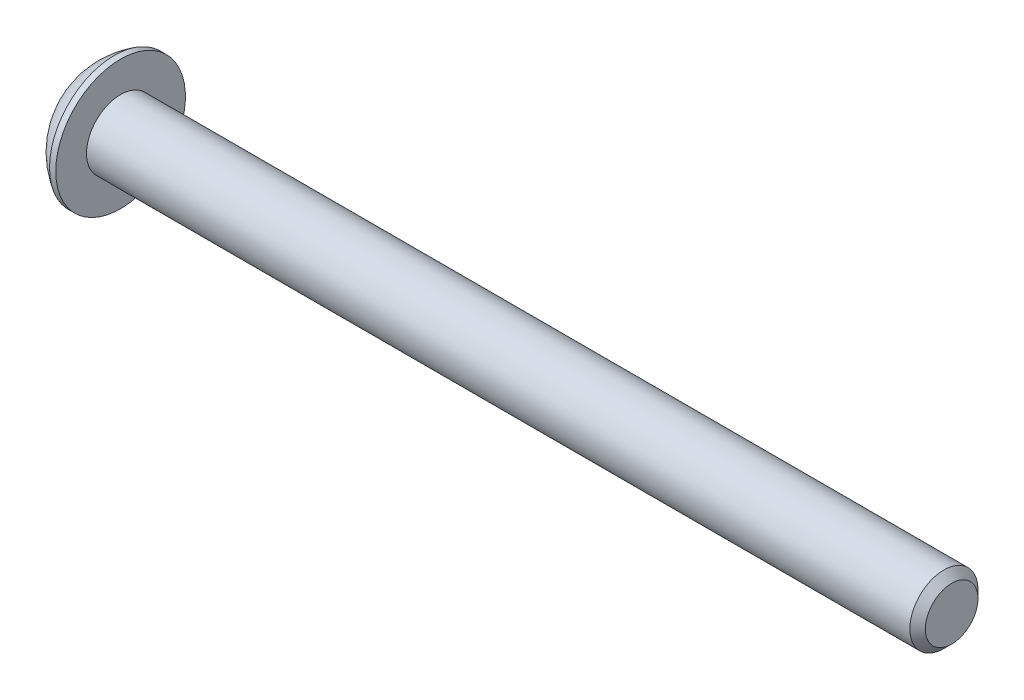
ISO-10303-21;
HEADER;
FILE_DESCRIPTION(('STEP AP214'),'2;1');
FILE_NAME('part.step','',(''),(''),'','','');
FILE_SCHEMA(('AUTOMOTIVE_DESIGN { 1 0 10303 214 1 1 1 1 }'));
ENDSEC;
DATA;
#1=APPLICATION_CONTEXT('core data for automotive mechanical design processes');
#2=APPLICATION_PROTOCOL_DEFINITION('international standard','automotive_design',2000,#1);
#3=PRODUCT_CONTEXT('',#1,'mechanical');
#4=PRODUCT('Part','Part','',(#3));
#5=PRODUCT_RELATED_PRODUCT_CATEGORY('part','',(#4));
#6=PRODUCT_DEFINITION_FORMATION('','',#4);
#7=PRODUCT_DEFINITION_CONTEXT('part definition',#1,'design');
#8=PRODUCT_DEFINITION('design','',#6,#7);
#9=PRODUCT_DEFINITION_SHAPE('','',#8);
#10=(LENGTH_UNIT() NAMED_UNIT(*) SI_UNIT(.MILLI.,.METRE.));
#11=(NAMED_UNIT(*) PLANE_ANGLE_UNIT() SI_UNIT($,.RADIAN.));
#12=(NAMED_UNIT(*) SI_UNIT($,.STERADIAN.) SOLID_ANGLE_UNIT());
#13=UNCERTAINTY_MEASURE_WITH_UNIT(LENGTH_MEASURE(1.E-05),#10,'distance_accuracy_value','');
#14=(GEOMETRIC_REPRESENTATION_CONTEXT(3) GLOBAL_UNCERTAINTY_ASSIGNED_CONTEXT((#13)) GLOBAL_UNIT_ASSIGNED_CONTEXT((#10,
#11,#12)) REPRESENTATION_CONTEXT('',''));
#15=CARTESIAN_POINT('',(0.,0.,0.));
#16=DIRECTION('',(0.,0.,1.));
#17=DIRECTION('',(1.,0.,0.));
#18=AXIS2_PLACEMENT_3D('',#15,#16,#17);
#19=CARTESIAN_POINT('',(1.32080000000034,0.,0.));
#20=DIRECTION('',(-1.,0.,0.));
#21=DIRECTION('',(0.,0.,1.));
#22=AXIS2_PLACEMENT_3D('',#19,#20,#21);
#23=CONICAL_SURFACE('',#22,1.1937999999998,1.04719755119608);
#24=CARTESIAN_POINT('',(2.01004075135902,0.,4.44089209850063E-13));
#25=VERTEX_POINT('',#24);
#26=VERTEX_LOOP('',#25);
#27=FACE_BOUND('',#26,.T.);
#28=CARTESIAN_POINT('',(1.32080000000009,0.,0.));
#29=DIRECTION('',(-1.,0.,0.));
#30=DIRECTION('',(0.,0.,1.));
#31=AXIS2_PLACEMENT_3D('',#28,#29,#30);
#32=CIRCLE('',#31,1.19380000000024);
#33=CARTESIAN_POINT('',(1.32080000000004,-1.03386112703797,0.59690000000006));
#34=VERTEX_POINT('',#33);
#35=CARTESIAN_POINT('',(1.32080000000004,0.,1.19380000000012));
#36=VERTEX_POINT('',#35);
#37=EDGE_CURVE('E19',#34,#36,#32,.T.);
#38=ORIENTED_EDGE('',*,*,#37,.T.);
#39=CARTESIAN_POINT('',(1.32080000000009,0.,0.));
#40=DIRECTION('',(-1.,0.,0.));
#41=DIRECTION('',(0.,0.,1.));
#42=AXIS2_PLACEMENT_3D('',#39,#40,#41);
#43=CIRCLE('',#42,1.19380000000024);
#44=CARTESIAN_POINT('',(1.32080000000004,1.03386112703797,0.596900000000061));
#45=VERTEX_POINT('',#44);
#46=EDGE_CURVE('E148',#36,#45,#43,.T.);
#47=ORIENTED_EDGE('',*,*,#46,.T.);
#48=CARTESIAN_POINT('',(1.32080000000009,0.,0.));
#49=DIRECTION('',(-1.,0.,0.));
#50=DIRECTION('',(0.,0.,1.));
#51=AXIS2_PLACEMENT_3D('',#48,#49,#50);
#52=CIRCLE('',#51,1.19380000000024);
#53=CARTESIAN_POINT('',(1.32080000000004,1.03386112703797,-0.596900000000061));
#54=VERTEX_POINT('',#53);
#55=EDGE_CURVE('E318',#45,#54,#52,.T.);
#56=ORIENTED_EDGE('',*,*,#55,.T.);
#57=CARTESIAN_POINT('',(1.32080000000009,0.,0.));
#58=DIRECTION('',(-1.,0.,0.));
#59=DIRECTION('',(0.,0.,1.));
#60=AXIS2_PLACEMENT_3D('',#57,#58,#59);
#61=CIRCLE('',#60,1.19380000000024);
#62=CARTESIAN_POINT('',(1.32080000000004,1.49457637585666E-12,-1.19380000000012));
#63=VERTEX_POINT('',#62);
#64=EDGE_CURVE('E319',#54,#63,#61,.T.);
#65=ORIENTED_EDGE('',*,*,#64,.T.);
#66=CARTESIAN_POINT('',(1.32080000000009,0.,0.));
#67=DIRECTION('',(-1.,0.,0.));
#68=DIRECTION('',(0.,0.,1.));
#69=AXIS2_PLACEMENT_3D('',#66,#67,#68);
#70=CIRCLE('',#69,1.19380000000024);
#71=CARTESIAN_POINT('',(1.32080000000004,-1.03386112703797,-0.59690000000006));
#72=VERTEX_POINT('',#71);
#73=EDGE_CURVE('E92',#63,#72,#70,.T.);
#74=ORIENTED_EDGE('',*,*,#73,.T.);
#75=CARTESIAN_POINT('',(1.32080000000009,0.,0.));
#76=DIRECTION('',(-1.,0.,0.));
#77=DIRECTION('',(0.,0.,1.));
#78=AXIS2_PLACEMENT_3D('',#75,#76,#77);
#79=CIRCLE('',#78,1.19380000000024);
#80=EDGE_CURVE('E88',#72,#34,#79,.T.);
#81=ORIENTED_EDGE('',*,*,#80,.T.);
#82=EDGE_LOOP('',(#38,#47,#56,#65,#74,#81));
#83=FACE_BOUND('',#82,.T.);
#84=ADVANCED_FACE('F16',(#27,#83),#23,.F.);
#85=CARTESIAN_POINT('',(1.3208,-2.06772225407572,-1.1938));
#86=DIRECTION('',(1.,0.,0.));
#87=DIRECTION('',(0.,0.,-1.));
#88=AXIS2_PLACEMENT_3D('',#85,#86,#87);
#89=PLANE('',#88);
#90=DIRECTION('',(0.,0.5,0.866025403784439));
#91=VECTOR('',#90,1.);
#92=CARTESIAN_POINT('',(1.3208,-1.37848150271715,0.));
#93=LINE('',#92,#91);
#94=CARTESIAN_POINT('',(1.3208,-0.689240751358574,1.1938));
#95=VERTEX_POINT('',#94);
#96=EDGE_CURVE('E100',#95,#34,#93,.F.);
#97=ORIENTED_EDGE('',*,*,#96,.F.);
#98=DIRECTION('',(0.,1.,0.));
#99=VECTOR('',#98,1.);
#100=CARTESIAN_POINT('',(1.3208,-0.689240751358574,1.1938));
#101=LINE('',#100,#99);
#102=EDGE_CURVE('E102',#36,#95,#101,.F.);
#103=ORIENTED_EDGE('',*,*,#102,.F.);
#104=ORIENTED_EDGE('',*,*,#37,.F.);
#105=EDGE_LOOP('',(#97,#103,#104));
#106=FACE_BOUND('',#105,.T.);
#107=ADVANCED_FACE('F98',(#106),#89,.F.);
#108=CARTESIAN_POINT('',(1.3208,-2.06772225407572,-1.1938));
#109=DIRECTION('',(1.,0.,0.));
#110=DIRECTION('',(0.,0.,-1.));
#111=AXIS2_PLACEMENT_3D('',#108,#109,#110);
#112=PLANE('',#111);
#113=DIRECTION('',(0.,-0.5,0.866025403784439));
#114=VECTOR('',#113,1.);
#115=CARTESIAN_POINT('',(1.3208,-0.689240751358574,-1.1938));
#116=LINE('',#115,#114);
#117=CARTESIAN_POINT('',(1.3208,-1.37848150271715,0.));
#118=VERTEX_POINT('',#117);
#119=EDGE_CURVE('E108',#118,#72,#116,.F.);
#120=ORIENTED_EDGE('',*,*,#119,.F.);
#121=DIRECTION('',(0.,0.5,0.866025403784439));
#122=VECTOR('',#121,1.);
#123=CARTESIAN_POINT('',(1.3208,-1.37848150271715,0.));
#124=LINE('',#123,#122);
#125=EDGE_CURVE('E105',#34,#118,#124,.F.);
#126=ORIENTED_EDGE('',*,*,#125,.F.);
#127=ORIENTED_EDGE('',*,*,#80,.F.);
#128=EDGE_LOOP('',(#120,#126,#127));
#129=FACE_BOUND('',#128,.T.);
#130=ADVANCED_FACE('F106',(#129),#112,.F.);
#131=CARTESIAN_POINT('',(1.3208,-2.06772225407572,-1.1938));
#132=DIRECTION('',(1.,0.,0.));
#133=DIRECTION('',(0.,0.,-1.));
#134=AXIS2_PLACEMENT_3D('',#131,#132,#133);
#135=PLANE('',#134);
#136=DIRECTION('',(0.,1.,0.));
#137=VECTOR('',#136,1.);
#138=CARTESIAN_POINT('',(1.3208,0.689240751358577,-1.1938));
#139=LINE('',#138,#137);
#140=CARTESIAN_POINT('',(1.3208,-0.689240751358574,-1.1938));
#141=VERTEX_POINT('',#140);
#142=EDGE_CURVE('E288',#141,#63,#139,.T.);
#143=ORIENTED_EDGE('',*,*,#142,.F.);
#144=DIRECTION('',(0.,-0.5,0.866025403784439));
#145=VECTOR('',#144,1.);
#146=CARTESIAN_POINT('',(1.3208,-0.689240751358574,-1.1938));
#147=LINE('',#146,#145);
#148=EDGE_CURVE('E300',#72,#141,#147,.F.);
#149=ORIENTED_EDGE('',*,*,#148,.F.);
#150=ORIENTED_EDGE('',*,*,#73,.F.);
#151=EDGE_LOOP('',(#143,#149,#150));
#152=FACE_BOUND('',#151,.T.);
#153=ADVANCED_FACE('F191',(#152),#135,.F.);
#154=CARTESIAN_POINT('',(1.3208,-2.06772225407572,-1.1938));
#155=DIRECTION('',(1.,0.,0.));
#156=DIRECTION('',(0.,0.,-1.));
#157=AXIS2_PLACEMENT_3D('',#154,#155,#156);
#158=PLANE('',#157);
#159=DIRECTION('',(0.,-0.5,-0.866025403784439));
#160=VECTOR('',#159,1.);
#161=CARTESIAN_POINT('',(1.3208,1.37848150271715,0.));
#162=LINE('',#161,#160);
#163=CARTESIAN_POINT('',(1.3208,0.689240751358577,-1.1938));
#164=VERTEX_POINT('',#163);
#165=EDGE_CURVE('E274',#164,#54,#162,.F.);
#166=ORIENTED_EDGE('',*,*,#165,.F.);
#167=DIRECTION('',(0.,1.,0.));
#168=VECTOR('',#167,1.);
#169=CARTESIAN_POINT('',(1.3208,0.689240751358577,-1.1938));
#170=LINE('',#169,#168);
#171=EDGE_CURVE('E285',#63,#164,#170,.T.);
#172=ORIENTED_EDGE('',*,*,#171,.F.);
#173=ORIENTED_EDGE('',*,*,#64,.F.);
#174=EDGE_LOOP('',(#166,#172,#173));
#175=FACE_BOUND('',#174,.T.);
#176=ADVANCED_FACE('F187',(#175),#158,.F.);
#177=CARTESIAN_POINT('',(1.3208,-2.06772225407572,-1.1938));
#178=DIRECTION('',(1.,0.,0.));
#179=DIRECTION('',(0.,0.,-1.));
#180=AXIS2_PLACEMENT_3D('',#177,#178,#179);
#181=PLANE('',#180);
#182=DIRECTION('',(0.,0.5,-0.866025403784439));
#183=VECTOR('',#182,1.);
#184=CARTESIAN_POINT('',(1.3208,0.689240751358576,1.1938));
#185=LINE('',#184,#183);
#186=CARTESIAN_POINT('',(1.3208,1.37848150271715,0.));
#187=VERTEX_POINT('',#186);
#188=EDGE_CURVE('E253',#187,#45,#185,.F.);
#189=ORIENTED_EDGE('',*,*,#188,.F.);
#190=DIRECTION('',(0.,-0.5,-0.866025403784439));
#191=VECTOR('',#190,1.);
#192=CARTESIAN_POINT('',(1.3208,1.37848150271715,0.));
#193=LINE('',#192,#191);
#194=EDGE_CURVE('E272',#54,#187,#193,.F.);
#195=ORIENTED_EDGE('',*,*,#194,.F.);
#196=ORIENTED_EDGE('',*,*,#55,.F.);
#197=EDGE_LOOP('',(#189,#195,#196));
#198=FACE_BOUND('',#197,.T.);
#199=ADVANCED_FACE('F183',(#198),#181,.F.);
#200=CARTESIAN_POINT('',(1.3208,-2.06772225407572,-1.1938));
#201=DIRECTION('',(1.,0.,0.));
#202=DIRECTION('',(0.,0.,-1.));
#203=AXIS2_PLACEMENT_3D('',#200,#201,#202);
#204=PLANE('',#203);
#205=DIRECTION('',(0.,1.,0.));
#206=VECTOR('',#205,1.);
#207=CARTESIAN_POINT('',(1.3208,-0.689240751358574,1.1938));
#208=LINE('',#207,#206);
#209=CARTESIAN_POINT('',(1.3208,0.689240751358576,1.1938));
#210=VERTEX_POINT('',#209);
#211=EDGE_CURVE('E117',#210,#36,#208,.F.);
#212=ORIENTED_EDGE('',*,*,#211,.F.);
#213=DIRECTION('',(0.,0.5,-0.866025403784439));
#214=VECTOR('',#213,1.);
#215=CARTESIAN_POINT('',(1.3208,0.689240751358576,1.1938));
#216=LINE('',#215,#214);
#217=EDGE_CURVE('E256',#45,#210,#216,.F.);
#218=ORIENTED_EDGE('',*,*,#217,.F.);
#219=ORIENTED_EDGE('',*,*,#46,.F.);
#220=EDGE_LOOP('',(#212,#218,#219));
#221=FACE_BOUND('',#220,.T.);
#222=ADVANCED_FACE('F179',(#221),#204,.F.);
#223=CARTESIAN_POINT('',(1.3208,-0.689240751358574,1.1938));
#224=DIRECTION('',(0.,0.,-1.));
#225=DIRECTION('',(0.,1.,0.));
#226=AXIS2_PLACEMENT_3D('',#223,#224,#225);
#227=PLANE('',#226);
#228=DIRECTION('',(0.,1.,0.));
#229=VECTOR('',#228,1.);
#230=CARTESIAN_POINT('',(0.,0.,1.1938));
#231=LINE('',#230,#229);
#232=CARTESIAN_POINT('',(0.,0.689240751358577,1.1938));
#233=VERTEX_POINT('',#232);
#234=CARTESIAN_POINT('',(0.,-0.689240751358574,1.1938));
#235=VERTEX_POINT('',#234);
#236=EDGE_CURVE('E250',#233,#235,#231,.F.);
#237=ORIENTED_EDGE('',*,*,#236,.F.);
#238=DIRECTION('',(1.,0.,0.));
#239=VECTOR('',#238,1.);
#240=CARTESIAN_POINT('',(1.3208,0.689240751358576,1.1938));
#241=LINE('',#240,#239);
#242=EDGE_CURVE('E262',#210,#233,#241,.F.);
#243=ORIENTED_EDGE('',*,*,#242,.F.);
#244=ORIENTED_EDGE('',*,*,#211,.T.);
#245=ORIENTED_EDGE('',*,*,#102,.T.);
#246=DIRECTION('',(1.,0.,0.));
#247=VECTOR('',#246,1.);
#248=CARTESIAN_POINT('',(1.3208,-0.689240751358574,1.1938));
#249=LINE('',#248,#247);
#250=EDGE_CURVE('E111',#235,#95,#249,.T.);
#251=ORIENTED_EDGE('',*,*,#250,.F.);
#252=EDGE_LOOP('',(#237,#243,#244,#245,#251));
#253=FACE_BOUND('',#252,.T.);
#254=ADVANCED_FACE('F176',(#253),#227,.T.);
#255=CARTESIAN_POINT('',(1.3208,-1.37848150271715,0.));
#256=DIRECTION('',(0.,0.866025403784439,-0.5));
#257=DIRECTION('',(0.,0.5,0.866025403784439));
#258=AXIS2_PLACEMENT_3D('',#255,#256,#257);
#259=PLANE('',#258);
#260=DIRECTION('',(0.,-0.5,-0.866025403784439));
#261=VECTOR('',#260,1.);
#262=CARTESIAN_POINT('',(0.,-0.689240751358574,1.1938));
#263=LINE('',#262,#261);
#264=CARTESIAN_POINT('',(0.,-1.37848150271715,0.));
#265=VERTEX_POINT('',#264);
#266=EDGE_CURVE('E247',#235,#265,#263,.T.);
#267=ORIENTED_EDGE('',*,*,#266,.F.);
#268=ORIENTED_EDGE('',*,*,#250,.T.);
#269=ORIENTED_EDGE('',*,*,#96,.T.);
#270=ORIENTED_EDGE('',*,*,#125,.T.);
#271=DIRECTION('',(1.,0.,0.));
#272=VECTOR('',#271,1.);
#273=CARTESIAN_POINT('',(1.3208,-1.37848150271715,0.));
#274=LINE('',#273,#272);
#275=EDGE_CURVE('E297',#265,#118,#274,.T.);
#276=ORIENTED_EDGE('',*,*,#275,.F.);
#277=EDGE_LOOP('',(#267,#268,#269,#270,#276));
#278=FACE_BOUND('',#277,.T.);
#279=ADVANCED_FACE('F115',(#278),#259,.T.);
#280=CARTESIAN_POINT('',(1.3208,-0.689240751358574,-1.1938));
#281=DIRECTION('',(0.,0.866025403784439,0.5));
#282=DIRECTION('',(0.,-0.5,0.866025403784439));
#283=AXIS2_PLACEMENT_3D('',#280,#281,#282);
#284=PLANE('',#283);
#285=DIRECTION('',(0.,0.5,-0.866025403784439));
#286=VECTOR('',#285,1.);
#287=CARTESIAN_POINT('',(0.,-1.37848150271715,0.));
#288=LINE('',#287,#286);
#289=CARTESIAN_POINT('',(0.,-0.689240751358574,-1.1938));
#290=VERTEX_POINT('',#289);
#291=EDGE_CURVE('E244',#265,#290,#288,.T.);
#292=ORIENTED_EDGE('',*,*,#291,.F.);
#293=ORIENTED_EDGE('',*,*,#275,.T.);
#294=ORIENTED_EDGE('',*,*,#119,.T.);
#295=ORIENTED_EDGE('',*,*,#148,.T.);
#296=DIRECTION('',(1.,0.,0.));
#297=VECTOR('',#296,1.);
#298=CARTESIAN_POINT('',(1.3208,-0.689240751358574,-1.1938));
#299=LINE('',#298,#297);
#300=EDGE_CURVE('E282',#290,#141,#299,.T.);
#301=ORIENTED_EDGE('',*,*,#300,.F.);
#302=EDGE_LOOP('',(#292,#293,#294,#295,#301));
#303=FACE_BOUND('',#302,.T.);
#304=ADVANCED_FACE('F169',(#303),#284,.T.);
#305=CARTESIAN_POINT('',(1.3208,0.689240751358577,-1.1938));
#306=DIRECTION('',(0.,0.,1.));
#307=DIRECTION('',(1.,0.,0.));
#308=AXIS2_PLACEMENT_3D('',#305,#306,#307);
#309=PLANE('',#308);
#310=DIRECTION('',(0.,1.,0.));
#311=VECTOR('',#310,1.);
#312=CARTESIAN_POINT('',(0.,0.,-1.1938));
#313=LINE('',#312,#311);
#314=CARTESIAN_POINT('',(0.,0.689240751358577,-1.1938));
#315=VERTEX_POINT('',#314);
#316=EDGE_CURVE('E241',#290,#315,#313,.T.);
#317=ORIENTED_EDGE('',*,*,#316,.F.);
#318=ORIENTED_EDGE('',*,*,#300,.T.);
#319=ORIENTED_EDGE('',*,*,#142,.T.);
#320=ORIENTED_EDGE('',*,*,#171,.T.);
#321=DIRECTION('',(1.,0.,0.));
#322=VECTOR('',#321,1.);
#323=CARTESIAN_POINT('',(1.3208,0.689240751358577,-1.1938));
#324=LINE('',#323,#322);
#325=EDGE_CURVE('E257',#315,#164,#324,.T.);
#326=ORIENTED_EDGE('',*,*,#325,.F.);
#327=EDGE_LOOP('',(#317,#318,#319,#320,#326));
#328=FACE_BOUND('',#327,.T.);
#329=ADVANCED_FACE('F166',(#328),#309,.T.);
#330=CARTESIAN_POINT('',(1.3208,1.37848150271715,0.));
#331=DIRECTION('',(0.,-0.866025403784439,0.5));
#332=DIRECTION('',(0.,-0.5,-0.866025403784439));
#333=AXIS2_PLACEMENT_3D('',#330,#331,#332);
#334=PLANE('',#333);
#335=DIRECTION('',(0.,0.5,0.866025403784439));
#336=VECTOR('',#335,1.);
#337=CARTESIAN_POINT('',(0.,0.689240751358577,-1.1938));
#338=LINE('',#337,#336);
#339=CARTESIAN_POINT('',(0.,1.37848150271715,0.));
#340=VERTEX_POINT('',#339);
#341=EDGE_CURVE('E238',#315,#340,#338,.T.);
#342=ORIENTED_EDGE('',*,*,#341,.F.);
#343=ORIENTED_EDGE('',*,*,#325,.T.);
#344=ORIENTED_EDGE('',*,*,#165,.T.);
#345=ORIENTED_EDGE('',*,*,#194,.T.);
#346=DIRECTION('',(1.,0.,0.));
#347=VECTOR('',#346,1.);
#348=CARTESIAN_POINT('',(1.3208,1.37848150271715,0.));
#349=LINE('',#348,#347);
#350=EDGE_CURVE('E34',#340,#187,#349,.T.);
#351=ORIENTED_EDGE('',*,*,#350,.F.);
#352=EDGE_LOOP('',(#342,#343,#344,#345,#351));
#353=FACE_BOUND('',#352,.T.);
#354=ADVANCED_FACE('F162',(#353),#334,.T.);
#355=CARTESIAN_POINT('',(1.3208,0.689240751358576,1.1938));
#356=DIRECTION('',(0.,-0.866025403784439,-0.5));
#357=DIRECTION('',(0.,0.5,-0.866025403784439));
#358=AXIS2_PLACEMENT_3D('',#355,#356,#357);
#359=PLANE('',#358);
#360=DIRECTION('',(0.,-0.5,0.866025403784439));
#361=VECTOR('',#360,1.);
#362=CARTESIAN_POINT('',(0.,1.37848150271715,0.));
#363=LINE('',#362,#361);
#364=EDGE_CURVE('E147',#340,#233,#363,.T.);
#365=ORIENTED_EDGE('',*,*,#364,.F.);
#366=ORIENTED_EDGE('',*,*,#350,.T.);
#367=ORIENTED_EDGE('',*,*,#188,.T.);
#368=ORIENTED_EDGE('',*,*,#217,.T.);
#369=ORIENTED_EDGE('',*,*,#242,.T.);
#370=EDGE_LOOP('',(#365,#366,#367,#368,#369));
#371=FACE_BOUND('',#370,.T.);
#372=ADVANCED_FACE('F158',(#371),#359,.T.);
#373=CARTESIAN_POINT('',(0.,0.,0.));
#374=DIRECTION('',(-1.,0.,0.));
#375=DIRECTION('',(0.,0.,1.));
#376=AXIS2_PLACEMENT_3D('',#373,#374,#375);
#377=PLANE('',#376);
#378=ORIENTED_EDGE('',*,*,#341,.T.);
#379=ORIENTED_EDGE('',*,*,#364,.T.);
#380=ORIENTED_EDGE('',*,*,#236,.T.);
#381=ORIENTED_EDGE('',*,*,#266,.T.);
#382=ORIENTED_EDGE('',*,*,#291,.T.);
#383=ORIENTED_EDGE('',*,*,#316,.T.);
#384=EDGE_LOOP('',(#378,#379,#380,#381,#382,#383));
#385=FACE_BOUND('',#384,.T.);
#386=CARTESIAN_POINT('',(0.,1.9812,0.));
#387=CARTESIAN_POINT('',(0.,1.9811996664299,0.0556258831179428));
#388=CARTESIAN_POINT('',(0.,1.97885520380442,0.111261989398606));
#389=CARTESIAN_POINT('',(0.,1.96949260169541,0.222149719830458));
#390=CARTESIAN_POINT('',(0.,1.96247308239605,0.277401225602895));
#391=CARTESIAN_POINT('',(0.,1.94379192841038,0.387209508139747));
#392=CARTESIAN_POINT('',(-1.85325793235264E-13,1.93212292489526,0.441765039546365));
#393=CARTESIAN_POINT('',(1.86344214223505E-13,1.90422331175315,0.549729449347493));
#394=CARTESIAN_POINT('',(6.94543371897454E-13,1.88798900035338,0.603137359208869));
#395=CARTESIAN_POINT('',(1.15501975216981E-12,1.83266214476501,0.760839131321828));
#396=CARTESIAN_POINT('',(0.,1.78690023648845,0.862876433575429));
#397=CARTESIAN_POINT('',(0.,1.67887358150667,1.05780719540872));
#398=CARTESIAN_POINT('',(9.54193214892627E-13,1.6166082074585,1.15070030720801));
#399=CARTESIAN_POINT('',(5.94805591894675E-13,1.51224157140982,1.28116890915697));
#400=CARTESIAN_POINT('',(1.63221293851378E-13,1.4755970394354,1.32320451127026));
#401=CARTESIAN_POINT('',(-1.62196980336157E-13,1.39893832619713,1.40400288695709));
#402=CARTESIAN_POINT('',(0.,1.35892742784698,1.44276877695455));
#403=CARTESIAN_POINT('',(1.14362537325405E-13,1.23416504602197,1.55382272417904));
#404=CARTESIAN_POINT('',(0.,1.14466125559859,1.62089527952111));
#405=CARTESIAN_POINT('',(0.,0.955712144178167,1.7390221808118));
#406=CARTESIAN_POINT('',(0.,0.856267198233564,1.79007713076007));
#407=CARTESIAN_POINT('',(0.,0.650206345910843,1.87477637530954));
#408=CARTESIAN_POINT('',(0.,0.543590516134855,1.90842085586267));
#409=CARTESIAN_POINT('',(0.,0.326226155292018,1.95733039300656));
#410=CARTESIAN_POINT('',(0.,0.21547760215793,1.97259535144288));
#411=CARTESIAN_POINT('',(0.,-0.00701040587544639,1.98431697865418));
#412=CARTESIAN_POINT('',(0.,-0.118749860774734,1.98077364742917));
#413=CARTESIAN_POINT('',(0.,-0.340050178355485,1.95497485623825));
#414=CARTESIAN_POINT('',(0.,-0.449611052668255,1.93271949620218));
#415=CARTESIAN_POINT('',(0.,-0.663431110729174,1.87014138774523));
#416=CARTESIAN_POINT('',(0.,-0.76769023783852,1.82981844635272));
#417=CARTESIAN_POINT('',(0.,-0.968005760719347,1.73219968377096));
#418=CARTESIAN_POINT('',(0.,-1.0640618469811,1.6749032225164));
#419=CARTESIAN_POINT('',(0.,-1.19980276751283,1.57757371205873));
#420=CARTESIAN_POINT('',(0.,-1.24366557129213,1.54322665019466));
#421=CARTESIAN_POINT('',(0.,-1.32838995706696,1.47093063174264));
#422=CARTESIAN_POINT('',(0.,-1.36924860178706,1.43297823102439));
#423=CARTESIAN_POINT('',(0.,-1.48674671849223,1.31419842051173));
#424=CARTESIAN_POINT('',(0.,-1.55842832343237,1.22836221289311));
#425=CARTESIAN_POINT('',(0.,-1.6863396856475,1.04586168272493));
#426=CARTESIAN_POINT('',(0.,-1.7425700302488,0.949197771949774));
#427=CARTESIAN_POINT('',(0.,-1.8141614250401,0.798182600298684));
#428=CARTESIAN_POINT('',(0.,-1.83591780585875,0.746776203847791));
#429=CARTESIAN_POINT('',(0.,-1.87500754181092,0.642341081688636));
#430=CARTESIAN_POINT('',(0.,-1.89234447645404,0.589313708122847));
#431=CARTESIAN_POINT('',(0.,-1.92246053433554,0.482076273028395));
#432=CARTESIAN_POINT('',(0.,-1.93524685475118,0.42786822425751));
#433=CARTESIAN_POINT('',(0.,-1.95620937250494,0.318578151844611));
#434=CARTESIAN_POINT('',(0.,-1.96438692958147,0.263496390912872));
#435=CARTESIAN_POINT('',(0.,-1.97388528284653,0.173607715038558));
#436=CARTESIAN_POINT('',(0.,-1.97662743364426,0.138944718024998));
#437=CARTESIAN_POINT('',(0.,-1.98028489645283,0.0695224782567002));
#438=CARTESIAN_POINT('',(0.,-1.98120020846367,0.0347632355019631));
#439=CARTESIAN_POINT('',(0.,-1.9811996664299,-0.0556258831179437));
#440=CARTESIAN_POINT('',(0.,-1.97885520380442,-0.111261989398607));
#441=CARTESIAN_POINT('',(0.,-1.96949260169541,-0.222149719830459));
#442=CARTESIAN_POINT('',(0.,-1.96247308239605,-0.277401225602897));
#443=CARTESIAN_POINT('',(0.,-1.94379192841039,-0.387209508139749));
#444=CARTESIAN_POINT('',(-1.85269749640691E-13,-1.93212292489526,-0.441765039546367));
#445=CARTESIAN_POINT('',(1.86288125054388E-13,-1.90422331175315,-0.549729449347495));
#446=CARTESIAN_POINT('',(6.94525090263764E-13,-1.88798900035338,-0.603137359208872));
#447=CARTESIAN_POINT('',(1.15505622829081E-12,-1.83266214476501,-0.760839131321831));
#448=CARTESIAN_POINT('',(0.,-1.78690023648845,-0.862876433575431));
#449=CARTESIAN_POINT('',(0.,-1.67887358150667,-1.05780719540872));
#450=CARTESIAN_POINT('',(9.54248812869379E-13,-1.6166082074585,-1.15070030720801));
#451=CARTESIAN_POINT('',(5.94777756479239E-13,-1.51224157140982,-1.28116890915698));
#452=CARTESIAN_POINT('',(1.63138949183833E-13,-1.47559703943539,-1.32320451127027));
#453=CARTESIAN_POINT('',(-1.62114715061273E-13,-1.39893832619713,-1.40400288695709));
#454=CARTESIAN_POINT('',(0.,-1.35892742784699,-1.44276877695455));
#455=CARTESIAN_POINT('',(1.13760489124207E-13,-1.23416504602197,-1.55382272417904));
#456=CARTESIAN_POINT('',(0.,-1.14466125559859,-1.62089527952111));
#457=CARTESIAN_POINT('',(0.,-0.95571214417816,-1.73902218081179));
#458=CARTESIAN_POINT('',(0.,-0.856267198233559,-1.79007713076007));
#459=CARTESIAN_POINT('',(0.,-0.650206345910841,-1.87477637530954));
#460=CARTESIAN_POINT('',(0.,-0.543590516134854,-1.90842085586267));
#461=CARTESIAN_POINT('',(0.,-0.326226155292018,-1.95733039300657));
#462=CARTESIAN_POINT('',(0.,-0.215477602157929,-1.97259535144288));
#463=CARTESIAN_POINT('',(0.,0.0070104058754487,-1.98431697865418));
#464=CARTESIAN_POINT('',(0.,0.118749860774737,-1.98077364742916));
#465=CARTESIAN_POINT('',(0.,0.340050178355489,-1.95497485623824));
#466=CARTESIAN_POINT('',(0.,0.44961105266826,-1.93271949620218));
#467=CARTESIAN_POINT('',(0.,0.663431110729178,-1.87014138774524));
#468=CARTESIAN_POINT('',(0.,0.767690237838524,-1.82981844635272));
#469=CARTESIAN_POINT('',(0.,0.968005760719348,-1.73219968377096));
#470=CARTESIAN_POINT('',(0.,1.0640618469811,-1.67490322251639));
#471=CARTESIAN_POINT('',(0.,1.19980276751283,-1.57757371205873));
#472=CARTESIAN_POINT('',(0.,1.24366557129214,-1.54322665019465));
#473=CARTESIAN_POINT('',(0.,1.32838995706696,-1.47093063174263));
#474=CARTESIAN_POINT('',(0.,1.36924860178706,-1.43297823102439));
#475=CARTESIAN_POINT('',(0.,1.48674671849223,-1.31419842051172));
#476=CARTESIAN_POINT('',(0.,1.55842832343237,-1.22836221289311));
#477=CARTESIAN_POINT('',(0.,1.6863396856475,-1.04586168272492));
#478=CARTESIAN_POINT('',(0.,1.7425700302488,-0.949197771949768));
#479=CARTESIAN_POINT('',(0.,1.8141614250401,-0.798182600298677));
#480=CARTESIAN_POINT('',(0.,1.83591780585875,-0.746776203847785));
#481=CARTESIAN_POINT('',(0.,1.87500754181092,-0.64234108168863));
#482=CARTESIAN_POINT('',(0.,1.89234447645404,-0.589313708122841));
#483=CARTESIAN_POINT('',(0.,1.92246053433555,-0.482076273028389));
#484=CARTESIAN_POINT('',(0.,1.93524685475118,-0.427868224257505));
#485=CARTESIAN_POINT('',(0.,1.95620937250494,-0.318578151844605));
#486=CARTESIAN_POINT('',(0.,1.96438692958147,-0.263496390912866));
#487=CARTESIAN_POINT('',(0.,1.97388528284653,-0.173607715038553));
#488=CARTESIAN_POINT('',(0.,1.97662743364426,-0.138944718024994));
#489=CARTESIAN_POINT('',(0.,1.98028489645283,-0.0695224782566989));
#490=CARTESIAN_POINT('',(0.,1.98120020846367,-0.034763235501963));
#491=CARTESIAN_POINT('',(0.,1.9812,0.));
#492=B_SPLINE_CURVE_WITH_KNOTS('',3,(#386,#387,#388,#389,#390,#391,#392,#393,#394,#395,#396,
#397,#398,#399,#400,#401,#402,#403,#404,#405,#406,#407,#408,#409,#410,#411,#412,#413,#414,#415,
#416,#417,#418,#419,#420,#421,#422,#423,#424,#425,#426,#427,#428,#429,#430,#431,#432,#433,#434,
#435,#436,#437,#438,#439,#440,#441,#442,#443,#444,#445,#446,#447,#448,#449,#450,#451,#452,#453,
#454,#455,#456,#457,#458,#459,#460,#461,#462,#463,#464,#465,#466,#467,#468,#469,#470,#471,#472,
#473,#474,#475,#476,#477,#478,#479,#480,#481,#482,#483,#484,#485,#486,#487,#488,#489,#490,#491),
.UNSPECIFIED.,.T.,.F.,(4,2,2,2,2,2,2,2,2,2,2,2,2,2,2,2,2,2,2,2,2,2,2,2,2,2,2,2,2,2,2,2,2,2,2,2,
2,2,2,2,2,2,2,2,2,2,2,2,2,2,2,2,4),(0.,0.166845646007828,0.333740557374255,0.500901034367693,
0.668197445942386,1.00199278686282,1.33580081809885,1.50292354032982,1.6698851310853,
2.00370118900129,2.33750465770544,2.67130456115909,3.005106247238,3.33890793331696,
3.67270783677065,4.00651130547476,4.34032736339026,4.50728895414554,4.67441167637632,
5.00821970761259,5.34201504853332,5.50931146010827,5.67647193710191,5.84336684846844,
6.0102124944764,6.11448220058334,6.21875190669029,6.38559755269812,6.55249246406454,
6.71965294105798,6.88694935263268,7.22074469355311,7.55455272478915,7.72167544702011,
7.88863703777559,8.22245309569158,8.55625656439573,8.89005646784938,9.2238581539283,
9.55765984000725,9.89145974346094,10.2252632121651,10.5590792700806,10.7260408608358,
10.8931635830666,11.2269716143029,11.5607669552236,11.7280633667986,11.8952238437922,
12.0621187551587,12.2289644011667,12.3332341072736,12.4375038133806),.UNSPECIFIED.);
#493=CARTESIAN_POINT('',(0.,1.9812,0.));
#494=VERTEX_POINT('',#493);
#495=EDGE_CURVE('E139',#494,#494,#492,.T.);
#496=ORIENTED_EDGE('',*,*,#495,.F.);
#497=EDGE_LOOP('',(#496));
#498=FACE_BOUND('',#497,.T.);
#499=ADVANCED_FACE('F154',(#385,#498),#377,.T.);
#500=CARTESIAN_POINT('',(4.13385,0.,0.));
#501=DIRECTION('',(0.,1.,0.));
#502=DIRECTION('',(1.,0.,0.));
#503=AXIS2_PLACEMENT_3D('',#500,#501,#502);
#504=SPHERICAL_SURFACE('',#503,4.58408870578439);
#505=CARTESIAN_POINT('',(1.8288,0.,0.));
#506=DIRECTION('',(-1.,0.,0.));
#507=DIRECTION('',(0.,0.,1.));
#508=AXIS2_PLACEMENT_3D('',#505,#506,#507);
#509=CIRCLE('',#508,3.9624);
#510=CARTESIAN_POINT('',(1.8288,0.,3.9624));
#511=VERTEX_POINT('',#510);
#512=EDGE_CURVE('E136',#511,#511,#509,.F.);
#513=ORIENTED_EDGE('',*,*,#512,.F.);
#514=EDGE_LOOP('',(#513));
#515=FACE_BOUND('',#514,.T.);
#516=ORIENTED_EDGE('',*,*,#495,.T.);
#517=EDGE_LOOP('',(#516));
#518=FACE_BOUND('',#517,.T.);
#519=ADVANCED_FACE('F150',(#515,#518),#504,.T.);
#520=CARTESIAN_POINT('',(53.0098,0.,0.));
#521=DIRECTION('',(-1.,0.,0.));
#522=DIRECTION('',(0.,0.,1.));
#523=AXIS2_PLACEMENT_3D('',#520,#521,#522);
#524=PLANE('',#523);
#525=CARTESIAN_POINT('',(53.0097999999839,0.,0.));
#526=DIRECTION('',(-1.,0.,0.));
#527=DIRECTION('',(0.,0.,1.));
#528=AXIS2_PLACEMENT_3D('',#525,#526,#527);
#529=CIRCLE('',#528,1.61036000002923);
#530=CARTESIAN_POINT('',(53.0097999999839,0.,1.61036000002923));
#531=VERTEX_POINT('',#530);
#532=EDGE_CURVE('E133',#531,#531,#529,.T.);
#533=ORIENTED_EDGE('',*,*,#532,.F.);
#534=EDGE_LOOP('',(#533));
#535=FACE_BOUND('',#534,.T.);
#536=ADVANCED_FACE('F222',(#535),#524,.F.);
#537=CARTESIAN_POINT('',(0.,0.,0.));
#538=DIRECTION('',(-1.,0.,0.));
#539=DIRECTION('',(0.,0.,1.));
#540=AXIS2_PLACEMENT_3D('',#537,#538,#539);
#541=CYLINDRICAL_SURFACE('',#540,3.9624);
#542=ORIENTED_EDGE('',*,*,#512,.T.);
#543=EDGE_LOOP('',(#542));
#544=FACE_BOUND('',#543,.T.);
#545=CARTESIAN_POINT('',(2.2098,0.,0.));
#546=DIRECTION('',(-1.,0.,0.));
#547=DIRECTION('',(0.,0.,1.));
#548=AXIS2_PLACEMENT_3D('',#545,#546,#547);
#549=CIRCLE('',#548,3.9624);
#550=CARTESIAN_POINT('',(2.2098,0.,3.9624));
#551=VERTEX_POINT('',#550);
#552=EDGE_CURVE('E130',#551,#551,#549,.T.);
#553=ORIENTED_EDGE('',*,*,#552,.T.);
#554=EDGE_LOOP('',(#553));
#555=FACE_BOUND('',#554,.T.);
#556=ADVANCED_FACE('F219',(#544,#555),#541,.T.);
#557=CARTESIAN_POINT('',(52.5373600000307,0.,0.));
#558=DIRECTION('',(-1.,0.,0.));
#559=DIRECTION('',(0.,0.,1.));
#560=AXIS2_PLACEMENT_3D('',#557,#558,#559);
#561=CONICAL_SURFACE('',#560,2.08279999992556,0.785398163337289);
#562=ORIENTED_EDGE('',*,*,#532,.T.);
#563=EDGE_LOOP('',(#562));
#564=FACE_BOUND('',#563,.T.);
#565=CARTESIAN_POINT('',(52.53736,0.,0.));
#566=DIRECTION('',(-1.,0.,0.));
#567=DIRECTION('',(0.,0.,1.));
#568=AXIS2_PLACEMENT_3D('',#565,#566,#567);
#569=CIRCLE('',#568,2.0828);
#570=CARTESIAN_POINT('',(52.53736,0.,2.0828));
#571=VERTEX_POINT('',#570);
#572=EDGE_CURVE('E25',#571,#571,#569,.T.);
#573=ORIENTED_EDGE('',*,*,#572,.F.);
#574=EDGE_LOOP('',(#573));
#575=FACE_BOUND('',#574,.T.);
#576=ADVANCED_FACE('F211',(#564,#575),#561,.T.);
#577=CARTESIAN_POINT('',(2.2098,2.0828,0.));
#578=DIRECTION('',(-1.,0.,0.));
#579=DIRECTION('',(0.,0.,1.));
#580=AXIS2_PLACEMENT_3D('',#577,#578,#579);
#581=PLANE('',#580);
#582=CARTESIAN_POINT('',(2.2098,0.,0.));
#583=DIRECTION('',(-1.,0.,0.));
#584=DIRECTION('',(0.,0.,1.));
#585=AXIS2_PLACEMENT_3D('',#582,#583,#584);
#586=CIRCLE('',#585,2.0828);
#587=CARTESIAN_POINT('',(2.2098,0.,2.0828));
#588=VERTEX_POINT('',#587);
#589=EDGE_CURVE('E11',#588,#588,#586,.F.);
#590=ORIENTED_EDGE('',*,*,#589,.F.);
#591=EDGE_LOOP('',(#590));
#592=FACE_BOUND('',#591,.T.);
#593=ORIENTED_EDGE('',*,*,#552,.F.);
#594=EDGE_LOOP('',(#593));
#595=FACE_BOUND('',#594,.T.);
#596=ADVANCED_FACE('F205',(#592,#595),#581,.F.);
#597=CARTESIAN_POINT('',(0.,0.,0.));
#598=DIRECTION('',(-1.,0.,0.));
#599=DIRECTION('',(0.,0.,1.));
#600=AXIS2_PLACEMENT_3D('',#597,#598,#599);
#601=CYLINDRICAL_SURFACE('',#600,2.0828);
#602=ORIENTED_EDGE('',*,*,#572,.T.);
#603=EDGE_LOOP('',(#602));
#604=FACE_BOUND('',#603,.T.);
#605=ORIENTED_EDGE('',*,*,#589,.T.);
#606=EDGE_LOOP('',(#605));
#607=FACE_BOUND('',#606,.T.);
#608=ADVANCED_FACE('F203',(#604,#607),#601,.T.);
#609=CLOSED_SHELL('',(#84,#107,#130,#153,#176,#199,#222,#254,#279,#304,#329,#354,#372,#499,#519,
#536,#556,#576,#596,#608));
#610=MANIFOLD_SOLID_BREP('B1',#609);
#611=ADVANCED_BREP_SHAPE_REPRESENTATION('',(#18,#610),#14);
#612=SHAPE_DEFINITION_REPRESENTATION(#9,#611);
ENDSEC;
END-ISO-10303-21;
